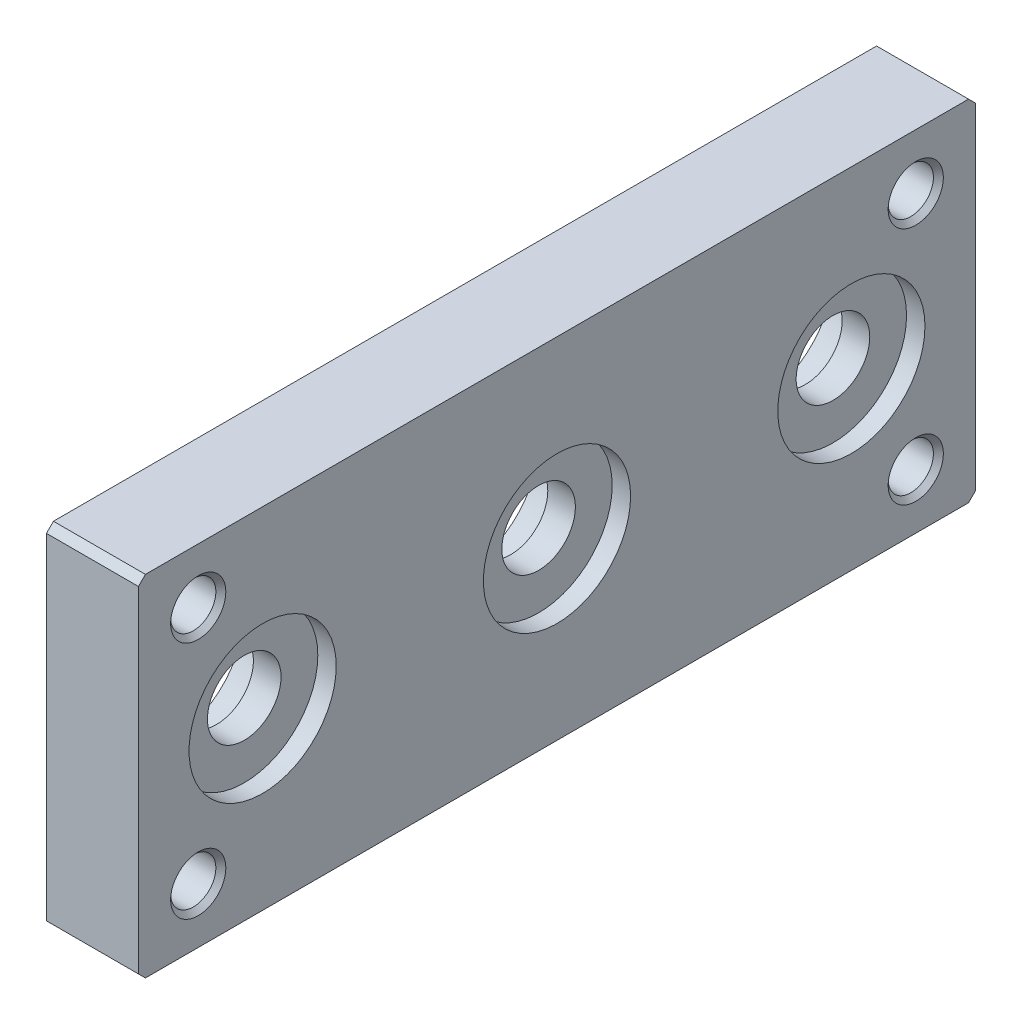
ISO-10303-21;
HEADER;
FILE_DESCRIPTION(('STEP AP214'),'2;1');
FILE_NAME('part.step','',(''),(''),'','','');
FILE_SCHEMA(('AUTOMOTIVE_DESIGN { 1 0 10303 214 1 1 1 1 }'));
ENDSEC;
DATA;
#1=APPLICATION_CONTEXT('core data for automotive mechanical design processes');
#2=APPLICATION_PROTOCOL_DEFINITION('international standard','automotive_design',2000,#1);
#3=PRODUCT_CONTEXT('',#1,'mechanical');
#4=PRODUCT('Part','Part','',(#3));
#5=PRODUCT_RELATED_PRODUCT_CATEGORY('part','',(#4));
#6=PRODUCT_DEFINITION_FORMATION('','',#4);
#7=PRODUCT_DEFINITION_CONTEXT('part definition',#1,'design');
#8=PRODUCT_DEFINITION('design','',#6,#7);
#9=PRODUCT_DEFINITION_SHAPE('','',#8);
#10=(LENGTH_UNIT() NAMED_UNIT(*) SI_UNIT(.MILLI.,.METRE.));
#11=(NAMED_UNIT(*) PLANE_ANGLE_UNIT() SI_UNIT($,.RADIAN.));
#12=(NAMED_UNIT(*) SI_UNIT($,.STERADIAN.) SOLID_ANGLE_UNIT());
#13=UNCERTAINTY_MEASURE_WITH_UNIT(LENGTH_MEASURE(1.E-05),#10,'distance_accuracy_value','');
#14=(GEOMETRIC_REPRESENTATION_CONTEXT(3) GLOBAL_UNCERTAINTY_ASSIGNED_CONTEXT((#13)) GLOBAL_UNIT_ASSIGNED_CONTEXT((#10,
#11,#12)) REPRESENTATION_CONTEXT('',''));
#15=CARTESIAN_POINT('',(0.,0.,0.));
#16=DIRECTION('',(0.,0.,1.));
#17=DIRECTION('',(1.,0.,0.));
#18=AXIS2_PLACEMENT_3D('',#15,#16,#17);
#19=CARTESIAN_POINT('',(-2.84529946162075,0.,-17.));
#20=DIRECTION('',(1.,0.,0.));
#21=DIRECTION('',(0.,0.,-1.));
#22=AXIS2_PLACEMENT_3D('',#19,#20,#21);
#23=CYLINDRICAL_SURFACE('',#22,2.);
#24=CARTESIAN_POINT('',(-7.,0.,-17.));
#25=DIRECTION('',(1.,0.,0.));
#26=DIRECTION('',(0.,0.,-1.));
#27=AXIS2_PLACEMENT_3D('',#24,#25,#26);
#28=CIRCLE('',#27,2.);
#29=CARTESIAN_POINT('',(-7.,2.,-17.));
#30=VERTEX_POINT('',#29);
#31=CARTESIAN_POINT('',(-7.,-2.,-17.));
#32=VERTEX_POINT('',#31);
#33=EDGE_CURVE('E387',#30,#32,#28,.T.);
#34=ORIENTED_EDGE('',*,*,#33,.F.);
#35=CARTESIAN_POINT('',(-7.,0.,-17.));
#36=DIRECTION('',(1.,0.,0.));
#37=DIRECTION('',(0.,0.,-1.));
#38=AXIS2_PLACEMENT_3D('',#35,#36,#37);
#39=CIRCLE('',#38,2.);
#40=EDGE_CURVE('E27',#32,#30,#39,.T.);
#41=ORIENTED_EDGE('',*,*,#40,.F.);
#42=EDGE_LOOP('',(#34,#41));
#43=FACE_BOUND('',#42,.T.);
#44=CARTESIAN_POINT('',(-4.,0.,-17.));
#45=DIRECTION('',(1.,0.,0.));
#46=DIRECTION('',(0.,0.,-1.));
#47=AXIS2_PLACEMENT_3D('',#44,#45,#46);
#48=CIRCLE('',#47,2.);
#49=CARTESIAN_POINT('',(-4.,0.,-19.));
#50=VERTEX_POINT('',#49);
#51=EDGE_CURVE('E11',#50,#50,#48,.T.);
#52=ORIENTED_EDGE('',*,*,#51,.T.);
#53=EDGE_LOOP('',(#52));
#54=FACE_BOUND('',#53,.T.);
#55=ADVANCED_FACE('F16',(#43,#54),#23,.F.);
#56=CARTESIAN_POINT('',(-4.,0.,-17.));
#57=DIRECTION('',(-1.,0.,0.));
#58=DIRECTION('',(0.,0.,1.));
#59=AXIS2_PLACEMENT_3D('',#56,#57,#58);
#60=CONICAL_SURFACE('',#59,2.,1.0471975511966);
#61=ORIENTED_EDGE('',*,*,#51,.F.);
#62=EDGE_LOOP('',(#61));
#63=FACE_BOUND('',#62,.T.);
#64=CARTESIAN_POINT('',(-2.84529946162075,0.,-17.));
#65=VERTEX_POINT('',#64);
#66=VERTEX_LOOP('',#65);
#67=FACE_BOUND('',#66,.T.);
#68=ADVANCED_FACE('F480',(#63,#67),#60,.F.);
#69=CARTESIAN_POINT('',(-7.,0.,-16.75));
#70=DIRECTION('',(1.,0.,0.));
#71=DIRECTION('',(0.,1.,0.));
#72=AXIS2_PLACEMENT_3D('',#69,#70,#71);
#73=PLANE('',#72);
#74=DIRECTION('',(0.,0.,-1.));
#75=VECTOR('',#74,1.);
#76=CARTESIAN_POINT('',(-7.,-2.,-16.75));
#77=LINE('',#76,#75);
#78=CARTESIAN_POINT('',(-7.,-2.,-17.25));
#79=VERTEX_POINT('',#78);
#80=EDGE_CURVE('E617',#32,#79,#77,.T.);
#81=ORIENTED_EDGE('',*,*,#80,.F.);
#82=ORIENTED_EDGE('',*,*,#40,.T.);
#83=DIRECTION('',(0.,0.,1.));
#84=VECTOR('',#83,1.);
#85=CARTESIAN_POINT('',(-7.,2.,-17.25));
#86=LINE('',#85,#84);
#87=CARTESIAN_POINT('',(-7.,2.,-17.25));
#88=VERTEX_POINT('',#87);
#89=EDGE_CURVE('E251',#88,#30,#86,.T.);
#90=ORIENTED_EDGE('',*,*,#89,.F.);
#91=CARTESIAN_POINT('',(-7.,0.,-17.25));
#92=DIRECTION('',(1.,0.,0.));
#93=DIRECTION('',(0.,0.,-1.));
#94=AXIS2_PLACEMENT_3D('',#91,#92,#93);
#95=CIRCLE('',#94,2.);
#96=EDGE_CURVE('E246',#79,#88,#95,.T.);
#97=ORIENTED_EDGE('',*,*,#96,.F.);
#98=EDGE_LOOP('',(#81,#82,#90,#97));
#99=FACE_BOUND('',#98,.T.);
#100=ADVANCED_FACE('F485',(#99),#73,.F.);
#101=CARTESIAN_POINT('',(-7.,0.,-17.25));
#102=DIRECTION('',(-1.,0.,0.));
#103=DIRECTION('',(0.,0.,1.));
#104=AXIS2_PLACEMENT_3D('',#101,#102,#103);
#105=CYLINDRICAL_SURFACE('',#104,2.);
#106=CARTESIAN_POINT('',(-10.,0.,-17.25));
#107=DIRECTION('',(1.,0.,0.));
#108=DIRECTION('',(0.,0.,-1.));
#109=AXIS2_PLACEMENT_3D('',#106,#107,#108);
#110=CIRCLE('',#109,2.);
#111=CARTESIAN_POINT('',(-10.,-2.,-17.25));
#112=VERTEX_POINT('',#111);
#113=CARTESIAN_POINT('',(-10.,2.,-17.25));
#114=VERTEX_POINT('',#113);
#115=EDGE_CURVE('E244',#112,#114,#110,.T.);
#116=ORIENTED_EDGE('',*,*,#115,.F.);
#117=DIRECTION('',(-1.,0.,0.));
#118=VECTOR('',#117,1.);
#119=CARTESIAN_POINT('',(-7.,-2.,-17.25));
#120=LINE('',#119,#118);
#121=EDGE_CURVE('E392',#79,#112,#120,.T.);
#122=ORIENTED_EDGE('',*,*,#121,.F.);
#123=ORIENTED_EDGE('',*,*,#96,.T.);
#124=DIRECTION('',(-1.,0.,0.));
#125=VECTOR('',#124,1.);
#126=CARTESIAN_POINT('',(-7.,2.,-17.25));
#127=LINE('',#126,#125);
#128=EDGE_CURVE('E239',#88,#114,#127,.T.);
#129=ORIENTED_EDGE('',*,*,#128,.T.);
#130=EDGE_LOOP('',(#116,#122,#123,#129));
#131=FACE_BOUND('',#130,.T.);
#132=ADVANCED_FACE('F241',(#131),#105,.F.);
#133=CARTESIAN_POINT('',(-7.,0.,-16.75));
#134=DIRECTION('',(-1.,0.,0.));
#135=DIRECTION('',(0.,0.,1.));
#136=AXIS2_PLACEMENT_3D('',#133,#134,#135);
#137=CYLINDRICAL_SURFACE('',#136,2.);
#138=CARTESIAN_POINT('',(-10.,0.,-16.75));
#139=DIRECTION('',(1.,0.,0.));
#140=DIRECTION('',(0.,0.,-1.));
#141=AXIS2_PLACEMENT_3D('',#138,#139,#140);
#142=CIRCLE('',#141,2.);
#143=CARTESIAN_POINT('',(-10.,2.,-16.75));
#144=VERTEX_POINT('',#143);
#145=CARTESIAN_POINT('',(-10.,-2.,-16.75));
#146=VERTEX_POINT('',#145);
#147=EDGE_CURVE('E274',#144,#146,#142,.T.);
#148=ORIENTED_EDGE('',*,*,#147,.F.);
#149=DIRECTION('',(-1.,0.,0.));
#150=VECTOR('',#149,1.);
#151=CARTESIAN_POINT('',(-7.,2.,-16.75));
#152=LINE('',#151,#150);
#153=CARTESIAN_POINT('',(-7.,2.,-16.75));
#154=VERTEX_POINT('',#153);
#155=EDGE_CURVE('E259',#154,#144,#152,.T.);
#156=ORIENTED_EDGE('',*,*,#155,.F.);
#157=CARTESIAN_POINT('',(-7.,0.,-16.75));
#158=DIRECTION('',(1.,0.,0.));
#159=DIRECTION('',(0.,0.,-1.));
#160=AXIS2_PLACEMENT_3D('',#157,#158,#159);
#161=CIRCLE('',#160,2.);
#162=CARTESIAN_POINT('',(-7.,-2.,-16.75));
#163=VERTEX_POINT('',#162);
#164=EDGE_CURVE('E391',#154,#163,#161,.T.);
#165=ORIENTED_EDGE('',*,*,#164,.T.);
#166=DIRECTION('',(-1.,0.,0.));
#167=VECTOR('',#166,1.);
#168=CARTESIAN_POINT('',(-7.,-2.,-16.75));
#169=LINE('',#168,#167);
#170=EDGE_CURVE('E295',#163,#146,#169,.T.);
#171=ORIENTED_EDGE('',*,*,#170,.T.);
#172=EDGE_LOOP('',(#148,#156,#165,#171));
#173=FACE_BOUND('',#172,.T.);
#174=ADVANCED_FACE('F547',(#173),#137,.F.);
#175=CARTESIAN_POINT('',(-7.,0.,-16.75));
#176=DIRECTION('',(1.,0.,0.));
#177=DIRECTION('',(0.,1.,0.));
#178=AXIS2_PLACEMENT_3D('',#175,#176,#177);
#179=PLANE('',#178);
#180=ORIENTED_EDGE('',*,*,#33,.T.);
#181=DIRECTION('',(0.,0.,-1.));
#182=VECTOR('',#181,1.);
#183=CARTESIAN_POINT('',(-7.,-2.,-16.75));
#184=LINE('',#183,#182);
#185=EDGE_CURVE('E299',#163,#32,#184,.T.);
#186=ORIENTED_EDGE('',*,*,#185,.F.);
#187=ORIENTED_EDGE('',*,*,#164,.F.);
#188=DIRECTION('',(0.,0.,1.));
#189=VECTOR('',#188,1.);
#190=CARTESIAN_POINT('',(-7.,2.,-17.25));
#191=LINE('',#190,#189);
#192=EDGE_CURVE('E342',#30,#154,#191,.T.);
#193=ORIENTED_EDGE('',*,*,#192,.F.);
#194=EDGE_LOOP('',(#180,#186,#187,#193));
#195=FACE_BOUND('',#194,.T.);
#196=ADVANCED_FACE('F550',(#195),#179,.F.);
#197=CARTESIAN_POINT('',(-7.,-2.,-16.75));
#198=DIRECTION('',(0.,1.,0.));
#199=DIRECTION('',(1.,0.,0.));
#200=AXIS2_PLACEMENT_3D('',#197,#198,#199);
#201=PLANE('',#200);
#202=DIRECTION('',(0.,0.,-1.));
#203=VECTOR('',#202,1.);
#204=CARTESIAN_POINT('',(-10.,-2.,-16.75));
#205=LINE('',#204,#203);
#206=EDGE_CURVE('E267',#146,#112,#205,.T.);
#207=ORIENTED_EDGE('',*,*,#206,.F.);
#208=ORIENTED_EDGE('',*,*,#170,.F.);
#209=ORIENTED_EDGE('',*,*,#185,.T.);
#210=ORIENTED_EDGE('',*,*,#80,.T.);
#211=ORIENTED_EDGE('',*,*,#121,.T.);
#212=EDGE_LOOP('',(#207,#208,#209,#210,#211));
#213=FACE_BOUND('',#212,.T.);
#214=ADVANCED_FACE('F530',(#213),#201,.T.);
#215=CARTESIAN_POINT('',(-7.,2.,-17.25));
#216=DIRECTION('',(0.,-1.,0.));
#217=DIRECTION('',(0.,0.,-1.));
#218=AXIS2_PLACEMENT_3D('',#215,#216,#217);
#219=PLANE('',#218);
#220=DIRECTION('',(0.,0.,1.));
#221=VECTOR('',#220,1.);
#222=CARTESIAN_POINT('',(-10.,2.,-17.25));
#223=LINE('',#222,#221);
#224=EDGE_CURVE('E255',#114,#144,#223,.T.);
#225=ORIENTED_EDGE('',*,*,#224,.F.);
#226=ORIENTED_EDGE('',*,*,#128,.F.);
#227=ORIENTED_EDGE('',*,*,#89,.T.);
#228=ORIENTED_EDGE('',*,*,#192,.T.);
#229=ORIENTED_EDGE('',*,*,#155,.T.);
#230=EDGE_LOOP('',(#225,#226,#227,#228,#229));
#231=FACE_BOUND('',#230,.T.);
#232=ADVANCED_FACE('F256',(#231),#219,.T.);
#233=CARTESIAN_POINT('',(-4.,0.,17.));
#234=DIRECTION('',(-1.,0.,0.));
#235=DIRECTION('',(0.,0.,1.));
#236=AXIS2_PLACEMENT_3D('',#233,#234,#235);
#237=CONICAL_SURFACE('',#236,2.,1.0471975511966);
#238=CARTESIAN_POINT('',(-4.,0.,17.));
#239=DIRECTION('',(1.,0.,0.));
#240=DIRECTION('',(0.,0.,-1.));
#241=AXIS2_PLACEMENT_3D('',#238,#239,#240);
#242=CIRCLE('',#241,2.);
#243=CARTESIAN_POINT('',(-4.,0.,15.));
#244=VERTEX_POINT('',#243);
#245=EDGE_CURVE('E252',#244,#244,#242,.T.);
#246=ORIENTED_EDGE('',*,*,#245,.F.);
#247=EDGE_LOOP('',(#246));
#248=FACE_BOUND('',#247,.T.);
#249=CARTESIAN_POINT('',(-2.84529946162075,0.,17.));
#250=VERTEX_POINT('',#249);
#251=VERTEX_LOOP('',#250);
#252=FACE_BOUND('',#251,.T.);
#253=ADVANCED_FACE('F473',(#248,#252),#237,.F.);
#254=CARTESIAN_POINT('',(-2.84529946162075,0.,17.));
#255=DIRECTION('',(1.,0.,0.));
#256=DIRECTION('',(0.,0.,-1.));
#257=AXIS2_PLACEMENT_3D('',#254,#255,#256);
#258=CYLINDRICAL_SURFACE('',#257,2.);
#259=CARTESIAN_POINT('',(-10.,0.,17.));
#260=DIRECTION('',(1.,0.,0.));
#261=DIRECTION('',(0.,0.,-1.));
#262=AXIS2_PLACEMENT_3D('',#259,#260,#261);
#263=CIRCLE('',#262,2.);
#264=CARTESIAN_POINT('',(-10.,0.,15.));
#265=VERTEX_POINT('',#264);
#266=EDGE_CURVE('E232',#265,#265,#263,.T.);
#267=ORIENTED_EDGE('',*,*,#266,.F.);
#268=EDGE_LOOP('',(#267));
#269=FACE_BOUND('',#268,.T.);
#270=ORIENTED_EDGE('',*,*,#245,.T.);
#271=EDGE_LOOP('',(#270));
#272=FACE_BOUND('',#271,.T.);
#273=ADVANCED_FACE('F462',(#269,#272),#258,.F.);
#274=CARTESIAN_POINT('',(0.,0.,0.));
#275=DIRECTION('',(1.,0.,0.));
#276=DIRECTION('',(0.,0.,-1.));
#277=AXIS2_PLACEMENT_3D('',#274,#275,#276);
#278=CYLINDRICAL_SURFACE('',#277,8.);
#279=CARTESIAN_POINT('',(-2.,0.,0.));
#280=DIRECTION('',(1.,0.,0.));
#281=DIRECTION('',(0.,0.,-1.));
#282=AXIS2_PLACEMENT_3D('',#279,#280,#281);
#283=CIRCLE('',#282,8.);
#284=CARTESIAN_POINT('',(-2.,0.,-8.));
#285=VERTEX_POINT('',#284);
#286=EDGE_CURVE('E284',#285,#285,#283,.T.);
#287=ORIENTED_EDGE('',*,*,#286,.F.);
#288=EDGE_LOOP('',(#287));
#289=FACE_BOUND('',#288,.T.);
#290=CARTESIAN_POINT('',(0.,0.,0.));
#291=DIRECTION('',(1.,0.,0.));
#292=DIRECTION('',(0.,0.,-1.));
#293=AXIS2_PLACEMENT_3D('',#290,#291,#292);
#294=CIRCLE('',#293,8.);
#295=CARTESIAN_POINT('',(0.,0.,-8.));
#296=VERTEX_POINT('',#295);
#297=EDGE_CURVE('E351',#296,#296,#294,.T.);
#298=ORIENTED_EDGE('',*,*,#297,.T.);
#299=EDGE_LOOP('',(#298));
#300=FACE_BOUND('',#299,.T.);
#301=ADVANCED_FACE('F459',(#289,#300),#278,.F.);
#302=CARTESIAN_POINT('',(-2.,0.,-4.));
#303=DIRECTION('',(1.,0.,0.));
#304=DIRECTION('',(0.,1.,0.));
#305=AXIS2_PLACEMENT_3D('',#302,#303,#304);
#306=PLANE('',#305);
#307=CARTESIAN_POINT('',(-2.,0.,0.));
#308=DIRECTION('',(1.,0.,0.));
#309=DIRECTION('',(0.,0.,-1.));
#310=AXIS2_PLACEMENT_3D('',#307,#308,#309);
#311=CIRCLE('',#310,4.);
#312=CARTESIAN_POINT('',(-2.,0.,-4.));
#313=VERTEX_POINT('',#312);
#314=EDGE_CURVE('E288',#313,#313,#311,.T.);
#315=ORIENTED_EDGE('',*,*,#314,.F.);
#316=EDGE_LOOP('',(#315));
#317=FACE_BOUND('',#316,.T.);
#318=ORIENTED_EDGE('',*,*,#286,.T.);
#319=EDGE_LOOP('',(#318));
#320=FACE_BOUND('',#319,.T.);
#321=ADVANCED_FACE('F461',(#317,#320),#306,.T.);
#322=CARTESIAN_POINT('',(0.,0.,0.));
#323=DIRECTION('',(1.,0.,0.));
#324=DIRECTION('',(0.,0.,-1.));
#325=AXIS2_PLACEMENT_3D('',#322,#323,#324);
#326=CYLINDRICAL_SURFACE('',#325,4.);
#327=CARTESIAN_POINT('',(-5.,0.,0.));
#328=DIRECTION('',(1.,0.,0.));
#329=DIRECTION('',(0.,0.,-1.));
#330=AXIS2_PLACEMENT_3D('',#327,#328,#329);
#331=CIRCLE('',#330,4.);
#332=CARTESIAN_POINT('',(-5.,0.,-4.));
#333=VERTEX_POINT('',#332);
#334=EDGE_CURVE('E306',#333,#333,#331,.T.);
#335=ORIENTED_EDGE('',*,*,#334,.F.);
#336=EDGE_LOOP('',(#335));
#337=FACE_BOUND('',#336,.T.);
#338=ORIENTED_EDGE('',*,*,#314,.T.);
#339=EDGE_LOOP('',(#338));
#340=FACE_BOUND('',#339,.T.);
#341=ADVANCED_FACE('F470',(#337,#340),#326,.F.);
#342=CARTESIAN_POINT('',(-5.,0.,-8.));
#343=DIRECTION('',(-1.,0.,0.));
#344=DIRECTION('',(0.,0.,1.));
#345=AXIS2_PLACEMENT_3D('',#342,#343,#344);
#346=PLANE('',#345);
#347=CARTESIAN_POINT('',(-5.,0.,0.));
#348=DIRECTION('',(1.,0.,0.));
#349=DIRECTION('',(0.,0.,-1.));
#350=AXIS2_PLACEMENT_3D('',#347,#348,#349);
#351=CIRCLE('',#350,8.);
#352=CARTESIAN_POINT('',(-5.,0.,-8.));
#353=VERTEX_POINT('',#352);
#354=EDGE_CURVE('E358',#353,#353,#351,.T.);
#355=ORIENTED_EDGE('',*,*,#354,.F.);
#356=EDGE_LOOP('',(#355));
#357=FACE_BOUND('',#356,.T.);
#358=ORIENTED_EDGE('',*,*,#334,.T.);
#359=EDGE_LOOP('',(#358));
#360=FACE_BOUND('',#359,.T.);
#361=ADVANCED_FACE('F522',(#357,#360),#346,.T.);
#362=CARTESIAN_POINT('',(0.,0.,0.));
#363=DIRECTION('',(1.,0.,0.));
#364=DIRECTION('',(0.,0.,-1.));
#365=AXIS2_PLACEMENT_3D('',#362,#363,#364);
#366=CYLINDRICAL_SURFACE('',#365,8.);
#367=CARTESIAN_POINT('',(-10.,0.,0.));
#368=DIRECTION('',(1.,0.,0.));
#369=DIRECTION('',(0.,0.,-1.));
#370=AXIS2_PLACEMENT_3D('',#367,#368,#369);
#371=CIRCLE('',#370,8.);
#372=CARTESIAN_POINT('',(-10.,0.,-8.));
#373=VERTEX_POINT('',#372);
#374=EDGE_CURVE('E314',#373,#373,#371,.T.);
#375=ORIENTED_EDGE('',*,*,#374,.F.);
#376=EDGE_LOOP('',(#375));
#377=FACE_BOUND('',#376,.T.);
#378=ORIENTED_EDGE('',*,*,#354,.T.);
#379=EDGE_LOOP('',(#378));
#380=FACE_BOUND('',#379,.T.);
#381=ADVANCED_FACE('F519',(#377,#380),#366,.F.);
#382=CARTESIAN_POINT('',(0.,0.,32.));
#383=DIRECTION('',(1.,0.,0.));
#384=DIRECTION('',(0.,0.,-1.));
#385=AXIS2_PLACEMENT_3D('',#382,#383,#384);
#386=CYLINDRICAL_SURFACE('',#385,8.);
#387=CARTESIAN_POINT('',(-2.,0.,32.));
#388=DIRECTION('',(1.,0.,0.));
#389=DIRECTION('',(0.,0.,-1.));
#390=AXIS2_PLACEMENT_3D('',#387,#388,#389);
#391=CIRCLE('',#390,8.);
#392=CARTESIAN_POINT('',(-2.,0.,24.));
#393=VERTEX_POINT('',#392);
#394=EDGE_CURVE('E374',#393,#393,#391,.T.);
#395=ORIENTED_EDGE('',*,*,#394,.F.);
#396=EDGE_LOOP('',(#395));
#397=FACE_BOUND('',#396,.T.);
#398=CARTESIAN_POINT('',(0.,0.,32.));
#399=DIRECTION('',(1.,0.,0.));
#400=DIRECTION('',(0.,0.,-1.));
#401=AXIS2_PLACEMENT_3D('',#398,#399,#400);
#402=CIRCLE('',#401,8.);
#403=CARTESIAN_POINT('',(0.,0.,24.));
#404=VERTEX_POINT('',#403);
#405=EDGE_CURVE('E347',#404,#404,#402,.T.);
#406=ORIENTED_EDGE('',*,*,#405,.T.);
#407=EDGE_LOOP('',(#406));
#408=FACE_BOUND('',#407,.T.);
#409=ADVANCED_FACE('F515',(#397,#408),#386,.F.);
#410=CARTESIAN_POINT('',(-2.,0.,28.));
#411=DIRECTION('',(1.,0.,0.));
#412=DIRECTION('',(0.,1.,0.));
#413=AXIS2_PLACEMENT_3D('',#410,#411,#412);
#414=PLANE('',#413);
#415=CARTESIAN_POINT('',(-2.,0.,32.));
#416=DIRECTION('',(1.,0.,0.));
#417=DIRECTION('',(0.,0.,-1.));
#418=AXIS2_PLACEMENT_3D('',#415,#416,#417);
#419=CIRCLE('',#418,4.);
#420=CARTESIAN_POINT('',(-2.,0.,28.));
#421=VERTEX_POINT('',#420);
#422=EDGE_CURVE('E378',#421,#421,#419,.T.);
#423=ORIENTED_EDGE('',*,*,#422,.F.);
#424=EDGE_LOOP('',(#423));
#425=FACE_BOUND('',#424,.T.);
#426=ORIENTED_EDGE('',*,*,#394,.T.);
#427=EDGE_LOOP('',(#426));
#428=FACE_BOUND('',#427,.T.);
#429=ADVANCED_FACE('F518',(#425,#428),#414,.T.);
#430=CARTESIAN_POINT('',(0.,0.,32.));
#431=DIRECTION('',(1.,0.,0.));
#432=DIRECTION('',(0.,0.,-1.));
#433=AXIS2_PLACEMENT_3D('',#430,#431,#432);
#434=CYLINDRICAL_SURFACE('',#433,4.);
#435=CARTESIAN_POINT('',(-5.,0.,32.));
#436=DIRECTION('',(1.,0.,0.));
#437=DIRECTION('',(0.,0.,-1.));
#438=AXIS2_PLACEMENT_3D('',#435,#436,#437);
#439=CIRCLE('',#438,4.);
#440=CARTESIAN_POINT('',(-5.,0.,28.));
#441=VERTEX_POINT('',#440);
#442=EDGE_CURVE('E409',#441,#441,#439,.T.);
#443=ORIENTED_EDGE('',*,*,#442,.F.);
#444=EDGE_LOOP('',(#443));
#445=FACE_BOUND('',#444,.T.);
#446=ORIENTED_EDGE('',*,*,#422,.T.);
#447=EDGE_LOOP('',(#446));
#448=FACE_BOUND('',#447,.T.);
#449=ADVANCED_FACE('F508',(#445,#448),#434,.F.);
#450=CARTESIAN_POINT('',(-5.,0.,24.));
#451=DIRECTION('',(-1.,0.,0.));
#452=DIRECTION('',(0.,0.,1.));
#453=AXIS2_PLACEMENT_3D('',#450,#451,#452);
#454=PLANE('',#453);
#455=CARTESIAN_POINT('',(-5.,0.,32.));
#456=DIRECTION('',(1.,0.,0.));
#457=DIRECTION('',(0.,0.,-1.));
#458=AXIS2_PLACEMENT_3D('',#455,#456,#457);
#459=CIRCLE('',#458,8.);
#460=CARTESIAN_POINT('',(-5.,0.,24.));
#461=VERTEX_POINT('',#460);
#462=EDGE_CURVE('E283',#461,#461,#459,.T.);
#463=ORIENTED_EDGE('',*,*,#462,.F.);
#464=EDGE_LOOP('',(#463));
#465=FACE_BOUND('',#464,.T.);
#466=ORIENTED_EDGE('',*,*,#442,.T.);
#467=EDGE_LOOP('',(#466));
#468=FACE_BOUND('',#467,.T.);
#469=ADVANCED_FACE('F504',(#465,#468),#454,.T.);
#470=CARTESIAN_POINT('',(0.,0.,32.));
#471=DIRECTION('',(1.,0.,0.));
#472=DIRECTION('',(0.,0.,-1.));
#473=AXIS2_PLACEMENT_3D('',#470,#471,#472);
#474=CYLINDRICAL_SURFACE('',#473,8.);
#475=CARTESIAN_POINT('',(-10.,0.,32.));
#476=DIRECTION('',(1.,0.,0.));
#477=DIRECTION('',(0.,0.,-1.));
#478=AXIS2_PLACEMENT_3D('',#475,#476,#477);
#479=CIRCLE('',#478,8.);
#480=CARTESIAN_POINT('',(-10.,0.,24.));
#481=VERTEX_POINT('',#480);
#482=EDGE_CURVE('E317',#481,#481,#479,.T.);
#483=ORIENTED_EDGE('',*,*,#482,.F.);
#484=EDGE_LOOP('',(#483));
#485=FACE_BOUND('',#484,.T.);
#486=ORIENTED_EDGE('',*,*,#462,.T.);
#487=EDGE_LOOP('',(#486));
#488=FACE_BOUND('',#487,.T.);
#489=ADVANCED_FACE('F500',(#485,#488),#474,.F.);
#490=CARTESIAN_POINT('',(0.,0.,-32.));
#491=DIRECTION('',(1.,0.,0.));
#492=DIRECTION('',(0.,0.,-1.));
#493=AXIS2_PLACEMENT_3D('',#490,#491,#492);
#494=CYLINDRICAL_SURFACE('',#493,8.);
#495=CARTESIAN_POINT('',(-2.,0.,-32.));
#496=DIRECTION('',(1.,0.,0.));
#497=DIRECTION('',(0.,0.,-1.));
#498=AXIS2_PLACEMENT_3D('',#495,#496,#497);
#499=CIRCLE('',#498,8.);
#500=CARTESIAN_POINT('',(-2.,0.,-40.));
#501=VERTEX_POINT('',#500);
#502=EDGE_CURVE('E280',#501,#501,#499,.T.);
#503=ORIENTED_EDGE('',*,*,#502,.F.);
#504=EDGE_LOOP('',(#503));
#505=FACE_BOUND('',#504,.T.);
#506=CARTESIAN_POINT('',(0.,0.,-32.));
#507=DIRECTION('',(1.,0.,0.));
#508=DIRECTION('',(0.,0.,-1.));
#509=AXIS2_PLACEMENT_3D('',#506,#507,#508);
#510=CIRCLE('',#509,8.);
#511=CARTESIAN_POINT('',(0.,0.,-40.));
#512=VERTEX_POINT('',#511);
#513=EDGE_CURVE('E350',#512,#512,#510,.T.);
#514=ORIENTED_EDGE('',*,*,#513,.T.);
#515=EDGE_LOOP('',(#514));
#516=FACE_BOUND('',#515,.T.);
#517=ADVANCED_FACE('F503',(#505,#516),#494,.F.);
#518=CARTESIAN_POINT('',(-2.,0.,-36.));
#519=DIRECTION('',(1.,0.,0.));
#520=DIRECTION('',(0.,1.,0.));
#521=AXIS2_PLACEMENT_3D('',#518,#519,#520);
#522=PLANE('',#521);
#523=CARTESIAN_POINT('',(-2.,0.,-32.));
#524=DIRECTION('',(1.,0.,0.));
#525=DIRECTION('',(0.,0.,-1.));
#526=AXIS2_PLACEMENT_3D('',#523,#524,#525);
#527=CIRCLE('',#526,4.);
#528=CARTESIAN_POINT('',(-2.,0.,-36.));
#529=VERTEX_POINT('',#528);
#530=EDGE_CURVE('E52',#529,#529,#527,.T.);
#531=ORIENTED_EDGE('',*,*,#530,.F.);
#532=EDGE_LOOP('',(#531));
#533=FACE_BOUND('',#532,.T.);
#534=ORIENTED_EDGE('',*,*,#502,.T.);
#535=EDGE_LOOP('',(#534));
#536=FACE_BOUND('',#535,.T.);
#537=ADVANCED_FACE('F531',(#533,#536),#522,.T.);
#538=CARTESIAN_POINT('',(0.,0.,-32.));
#539=DIRECTION('',(1.,0.,0.));
#540=DIRECTION('',(0.,0.,-1.));
#541=AXIS2_PLACEMENT_3D('',#538,#539,#540);
#542=CYLINDRICAL_SURFACE('',#541,4.);
#543=CARTESIAN_POINT('',(-5.,0.,-32.));
#544=DIRECTION('',(1.,0.,0.));
#545=DIRECTION('',(0.,0.,-1.));
#546=AXIS2_PLACEMENT_3D('',#543,#544,#545);
#547=CIRCLE('',#546,4.);
#548=CARTESIAN_POINT('',(-5.,0.,-36.));
#549=VERTEX_POINT('',#548);
#550=EDGE_CURVE('E64',#549,#549,#547,.T.);
#551=ORIENTED_EDGE('',*,*,#550,.F.);
#552=EDGE_LOOP('',(#551));
#553=FACE_BOUND('',#552,.T.);
#554=ORIENTED_EDGE('',*,*,#530,.T.);
#555=EDGE_LOOP('',(#554));
#556=FACE_BOUND('',#555,.T.);
#557=ADVANCED_FACE('F534',(#553,#556),#542,.F.);
#558=CARTESIAN_POINT('',(-5.,0.,-40.));
#559=DIRECTION('',(-1.,0.,0.));
#560=DIRECTION('',(0.,0.,1.));
#561=AXIS2_PLACEMENT_3D('',#558,#559,#560);
#562=PLANE('',#561);
#563=CARTESIAN_POINT('',(-5.,0.,-32.));
#564=DIRECTION('',(1.,0.,0.));
#565=DIRECTION('',(0.,0.,-1.));
#566=AXIS2_PLACEMENT_3D('',#563,#564,#565);
#567=CIRCLE('',#566,8.);
#568=CARTESIAN_POINT('',(-5.,0.,-40.));
#569=VERTEX_POINT('',#568);
#570=EDGE_CURVE('E333',#569,#569,#567,.T.);
#571=ORIENTED_EDGE('',*,*,#570,.F.);
#572=EDGE_LOOP('',(#571));
#573=FACE_BOUND('',#572,.T.);
#574=ORIENTED_EDGE('',*,*,#550,.T.);
#575=EDGE_LOOP('',(#574));
#576=FACE_BOUND('',#575,.T.);
#577=ADVANCED_FACE('F498',(#573,#576),#562,.T.);
#578=CARTESIAN_POINT('',(0.,0.,-32.));
#579=DIRECTION('',(1.,0.,0.));
#580=DIRECTION('',(0.,0.,-1.));
#581=AXIS2_PLACEMENT_3D('',#578,#579,#580);
#582=CYLINDRICAL_SURFACE('',#581,8.);
#583=CARTESIAN_POINT('',(-10.,0.,-32.));
#584=DIRECTION('',(1.,0.,0.));
#585=DIRECTION('',(0.,0.,-1.));
#586=AXIS2_PLACEMENT_3D('',#583,#584,#585);
#587=CIRCLE('',#586,8.);
#588=CARTESIAN_POINT('',(-10.,0.,-40.));
#589=VERTEX_POINT('',#588);
#590=EDGE_CURVE('E403',#589,#589,#587,.T.);
#591=ORIENTED_EDGE('',*,*,#590,.F.);
#592=EDGE_LOOP('',(#591));
#593=FACE_BOUND('',#592,.T.);
#594=ORIENTED_EDGE('',*,*,#570,.T.);
#595=EDGE_LOOP('',(#594));
#596=FACE_BOUND('',#595,.T.);
#597=ADVANCED_FACE('F441',(#593,#596),#582,.F.);
#598=CARTESIAN_POINT('',(-0.5415,13.,-39.));
#599=DIRECTION('',(1.,0.,0.));
#600=DIRECTION('',(0.,0.,-1.));
#601=AXIS2_PLACEMENT_3D('',#598,#599,#600);
#602=CONICAL_SURFACE('',#601,2.4585,0.785398163397448);
#603=CARTESIAN_POINT('',(-0.5415,13.,-39.));
#604=DIRECTION('',(1.,0.,0.));
#605=DIRECTION('',(0.,0.,-1.));
#606=AXIS2_PLACEMENT_3D('',#603,#604,#605);
#607=CIRCLE('',#606,2.4585);
#608=CARTESIAN_POINT('',(-0.5415,13.,-41.4585));
#609=VERTEX_POINT('',#608);
#610=EDGE_CURVE('E329',#609,#609,#607,.T.);
#611=ORIENTED_EDGE('',*,*,#610,.F.);
#612=EDGE_LOOP('',(#611));
#613=FACE_BOUND('',#612,.T.);
#614=CARTESIAN_POINT('',(0.,13.,-39.));
#615=DIRECTION('',(1.,0.,0.));
#616=DIRECTION('',(0.,0.,-1.));
#617=AXIS2_PLACEMENT_3D('',#614,#615,#616);
#618=CIRCLE('',#617,3.);
#619=CARTESIAN_POINT('',(0.,13.,-42.));
#620=VERTEX_POINT('',#619);
#621=EDGE_CURVE('E354',#620,#620,#618,.T.);
#622=ORIENTED_EDGE('',*,*,#621,.T.);
#623=EDGE_LOOP('',(#622));
#624=FACE_BOUND('',#623,.T.);
#625=ADVANCED_FACE('F433',(#613,#624),#602,.F.);
#626=CARTESIAN_POINT('',(0.,13.,-39.));
#627=DIRECTION('',(1.,0.,0.));
#628=DIRECTION('',(0.,0.,-1.));
#629=AXIS2_PLACEMENT_3D('',#626,#627,#628);
#630=CYLINDRICAL_SURFACE('',#629,2.4585);
#631=CARTESIAN_POINT('',(-9.4585,13.,-39.));
#632=DIRECTION('',(1.,0.,0.));
#633=DIRECTION('',(0.,0.,-1.));
#634=AXIS2_PLACEMENT_3D('',#631,#632,#633);
#635=CIRCLE('',#634,2.4585);
#636=CARTESIAN_POINT('',(-9.4585,13.,-41.4585));
#637=VERTEX_POINT('',#636);
#638=EDGE_CURVE('E334',#637,#637,#635,.T.);
#639=ORIENTED_EDGE('',*,*,#638,.F.);
#640=EDGE_LOOP('',(#639));
#641=FACE_BOUND('',#640,.T.);
#642=ORIENTED_EDGE('',*,*,#610,.T.);
#643=EDGE_LOOP('',(#642));
#644=FACE_BOUND('',#643,.T.);
#645=ADVANCED_FACE('F430',(#641,#644),#630,.F.);
#646=CARTESIAN_POINT('',(-10.,13.,-39.));
#647=DIRECTION('',(-1.,0.,0.));
#648=DIRECTION('',(0.,0.,1.));
#649=AXIS2_PLACEMENT_3D('',#646,#647,#648);
#650=CONICAL_SURFACE('',#649,3.,0.785398163397448);
#651=CARTESIAN_POINT('',(-10.,13.,-39.));
#652=DIRECTION('',(1.,0.,0.));
#653=DIRECTION('',(0.,0.,-1.));
#654=AXIS2_PLACEMENT_3D('',#651,#652,#653);
#655=CIRCLE('',#654,3.);
#656=CARTESIAN_POINT('',(-10.,13.,-42.));
#657=VERTEX_POINT('',#656);
#658=EDGE_CURVE('E373',#657,#657,#655,.T.);
#659=ORIENTED_EDGE('',*,*,#658,.F.);
#660=EDGE_LOOP('',(#659));
#661=FACE_BOUND('',#660,.T.);
#662=ORIENTED_EDGE('',*,*,#638,.T.);
#663=EDGE_LOOP('',(#662));
#664=FACE_BOUND('',#663,.T.);
#665=ADVANCED_FACE('F428',(#661,#664),#650,.F.);
#666=CARTESIAN_POINT('',(-0.5415,-13.,39.));
#667=DIRECTION('',(1.,0.,0.));
#668=DIRECTION('',(0.,0.,-1.));
#669=AXIS2_PLACEMENT_3D('',#666,#667,#668);
#670=CONICAL_SURFACE('',#669,2.4585,0.785398163397448);
#671=CARTESIAN_POINT('',(-0.5415,-13.,39.));
#672=DIRECTION('',(1.,0.,0.));
#673=DIRECTION('',(0.,0.,-1.));
#674=AXIS2_PLACEMENT_3D('',#671,#672,#673);
#675=CIRCLE('',#674,2.4585);
#676=CARTESIAN_POINT('',(-0.5415,-13.,36.5415));
#677=VERTEX_POINT('',#676);
#678=EDGE_CURVE('E420',#677,#677,#675,.T.);
#679=ORIENTED_EDGE('',*,*,#678,.F.);
#680=EDGE_LOOP('',(#679));
#681=FACE_BOUND('',#680,.T.);
#682=CARTESIAN_POINT('',(0.,-13.,39.));
#683=DIRECTION('',(1.,0.,0.));
#684=DIRECTION('',(0.,0.,-1.));
#685=AXIS2_PLACEMENT_3D('',#682,#683,#684);
#686=CIRCLE('',#685,3.);
#687=CARTESIAN_POINT('',(0.,-13.,36.));
#688=VERTEX_POINT('',#687);
#689=EDGE_CURVE('E302',#688,#688,#686,.T.);
#690=ORIENTED_EDGE('',*,*,#689,.T.);
#691=EDGE_LOOP('',(#690));
#692=FACE_BOUND('',#691,.T.);
#693=ADVANCED_FACE('F542',(#681,#692),#670,.F.);
#694=CARTESIAN_POINT('',(0.,-13.,39.));
#695=DIRECTION('',(1.,0.,0.));
#696=DIRECTION('',(0.,0.,-1.));
#697=AXIS2_PLACEMENT_3D('',#694,#695,#696);
#698=CYLINDRICAL_SURFACE('',#697,2.4585);
#699=CARTESIAN_POINT('',(-9.4585,-13.,39.));
#700=DIRECTION('',(1.,0.,0.));
#701=DIRECTION('',(0.,0.,-1.));
#702=AXIS2_PLACEMENT_3D('',#699,#700,#701);
#703=CIRCLE('',#702,2.4585);
#704=CARTESIAN_POINT('',(-9.4585,-13.,36.5415));
#705=VERTEX_POINT('',#704);
#706=EDGE_CURVE('E422',#705,#705,#703,.T.);
#707=ORIENTED_EDGE('',*,*,#706,.F.);
#708=EDGE_LOOP('',(#707));
#709=FACE_BOUND('',#708,.T.);
#710=ORIENTED_EDGE('',*,*,#678,.T.);
#711=EDGE_LOOP('',(#710));
#712=FACE_BOUND('',#711,.T.);
#713=ADVANCED_FACE('F545',(#709,#712),#698,.F.);
#714=CARTESIAN_POINT('',(-10.,-13.,39.));
#715=DIRECTION('',(-1.,0.,0.));
#716=DIRECTION('',(0.,0.,1.));
#717=AXIS2_PLACEMENT_3D('',#714,#715,#716);
#718=CONICAL_SURFACE('',#717,3.,0.785398163397448);
#719=CARTESIAN_POINT('',(-10.,-13.,39.));
#720=DIRECTION('',(1.,0.,0.));
#721=DIRECTION('',(0.,0.,-1.));
#722=AXIS2_PLACEMENT_3D('',#719,#720,#721);
#723=CIRCLE('',#722,3.);
#724=CARTESIAN_POINT('',(-10.,-13.,36.));
#725=VERTEX_POINT('',#724);
#726=EDGE_CURVE('E339',#725,#725,#723,.T.);
#727=ORIENTED_EDGE('',*,*,#726,.F.);
#728=EDGE_LOOP('',(#727));
#729=FACE_BOUND('',#728,.T.);
#730=ORIENTED_EDGE('',*,*,#706,.T.);
#731=EDGE_LOOP('',(#730));
#732=FACE_BOUND('',#731,.T.);
#733=ADVANCED_FACE('F949',(#729,#732),#718,.F.);
#734=CARTESIAN_POINT('',(-0.5415,-13.,-39.));
#735=DIRECTION('',(1.,0.,0.));
#736=DIRECTION('',(0.,0.,-1.));
#737=AXIS2_PLACEMENT_3D('',#734,#735,#736);
#738=CONICAL_SURFACE('',#737,2.4585,0.785398163397448);
#739=CARTESIAN_POINT('',(-0.5415,-13.,-39.));
#740=DIRECTION('',(1.,0.,0.));
#741=DIRECTION('',(0.,0.,-1.));
#742=AXIS2_PLACEMENT_3D('',#739,#740,#741);
#743=CIRCLE('',#742,2.4585);
#744=CARTESIAN_POINT('',(-0.5415,-13.,-41.4585));
#745=VERTEX_POINT('',#744);
#746=EDGE_CURVE('E610',#745,#745,#743,.T.);
#747=ORIENTED_EDGE('',*,*,#746,.F.);
#748=EDGE_LOOP('',(#747));
#749=FACE_BOUND('',#748,.T.);
#750=CARTESIAN_POINT('',(0.,-13.,-39.));
#751=DIRECTION('',(1.,0.,0.));
#752=DIRECTION('',(0.,0.,-1.));
#753=AXIS2_PLACEMENT_3D('',#750,#751,#752);
#754=CIRCLE('',#753,3.);
#755=CARTESIAN_POINT('',(0.,-13.,-42.));
#756=VERTEX_POINT('',#755);
#757=EDGE_CURVE('E172',#756,#756,#754,.T.);
#758=ORIENTED_EDGE('',*,*,#757,.T.);
#759=EDGE_LOOP('',(#758));
#760=FACE_BOUND('',#759,.T.);
#761=ADVANCED_FACE('F954',(#749,#760),#738,.F.);
#762=CARTESIAN_POINT('',(0.,-13.,-39.));
#763=DIRECTION('',(1.,0.,0.));
#764=DIRECTION('',(0.,0.,-1.));
#765=AXIS2_PLACEMENT_3D('',#762,#763,#764);
#766=CYLINDRICAL_SURFACE('',#765,2.4585);
#767=CARTESIAN_POINT('',(-9.4585,-13.,-39.));
#768=DIRECTION('',(1.,0.,0.));
#769=DIRECTION('',(0.,0.,-1.));
#770=AXIS2_PLACEMENT_3D('',#767,#768,#769);
#771=CIRCLE('',#770,2.4585);
#772=CARTESIAN_POINT('',(-9.4585,-13.,-41.4585));
#773=VERTEX_POINT('',#772);
#774=EDGE_CURVE('E623',#773,#773,#771,.T.);
#775=ORIENTED_EDGE('',*,*,#774,.F.);
#776=EDGE_LOOP('',(#775));
#777=FACE_BOUND('',#776,.T.);
#778=ORIENTED_EDGE('',*,*,#746,.T.);
#779=EDGE_LOOP('',(#778));
#780=FACE_BOUND('',#779,.T.);
#781=ADVANCED_FACE('F556',(#777,#780),#766,.F.);
#782=CARTESIAN_POINT('',(-10.,-13.,-39.));
#783=DIRECTION('',(-1.,0.,0.));
#784=DIRECTION('',(0.,0.,1.));
#785=AXIS2_PLACEMENT_3D('',#782,#783,#784);
#786=CONICAL_SURFACE('',#785,3.,0.785398163397448);
#787=CARTESIAN_POINT('',(-10.,-13.,-39.));
#788=DIRECTION('',(1.,0.,0.));
#789=DIRECTION('',(0.,0.,-1.));
#790=AXIS2_PLACEMENT_3D('',#787,#788,#789);
#791=CIRCLE('',#790,3.);
#792=CARTESIAN_POINT('',(-10.,-13.,-42.));
#793=VERTEX_POINT('',#792);
#794=EDGE_CURVE('E335',#793,#793,#791,.T.);
#795=ORIENTED_EDGE('',*,*,#794,.F.);
#796=EDGE_LOOP('',(#795));
#797=FACE_BOUND('',#796,.T.);
#798=ORIENTED_EDGE('',*,*,#774,.T.);
#799=EDGE_LOOP('',(#798));
#800=FACE_BOUND('',#799,.T.);
#801=ADVANCED_FACE('F552',(#797,#800),#786,.F.);
#802=CARTESIAN_POINT('',(-0.5415,13.,39.));
#803=DIRECTION('',(1.,0.,0.));
#804=DIRECTION('',(0.,0.,-1.));
#805=AXIS2_PLACEMENT_3D('',#802,#803,#804);
#806=CONICAL_SURFACE('',#805,2.4585,0.785398163397448);
#807=CARTESIAN_POINT('',(-0.5415,13.,39.));
#808=DIRECTION('',(1.,0.,0.));
#809=DIRECTION('',(0.,0.,-1.));
#810=AXIS2_PLACEMENT_3D('',#807,#808,#809);
#811=CIRCLE('',#810,2.4585);
#812=CARTESIAN_POINT('',(-0.5415,13.,36.5415));
#813=VERTEX_POINT('',#812);
#814=EDGE_CURVE('E627',#813,#813,#811,.T.);
#815=ORIENTED_EDGE('',*,*,#814,.F.);
#816=EDGE_LOOP('',(#815));
#817=FACE_BOUND('',#816,.T.);
#818=CARTESIAN_POINT('',(0.,13.,39.));
#819=DIRECTION('',(1.,0.,0.));
#820=DIRECTION('',(0.,0.,-1.));
#821=AXIS2_PLACEMENT_3D('',#818,#819,#820);
#822=CIRCLE('',#821,3.);
#823=CARTESIAN_POINT('',(0.,13.,36.));
#824=VERTEX_POINT('',#823);
#825=EDGE_CURVE('E159',#824,#824,#822,.T.);
#826=ORIENTED_EDGE('',*,*,#825,.T.);
#827=EDGE_LOOP('',(#826));
#828=FACE_BOUND('',#827,.T.);
#829=ADVANCED_FACE('F555',(#817,#828),#806,.F.);
#830=CARTESIAN_POINT('',(0.,13.,39.));
#831=DIRECTION('',(1.,0.,0.));
#832=DIRECTION('',(0.,0.,-1.));
#833=AXIS2_PLACEMENT_3D('',#830,#831,#832);
#834=CYLINDRICAL_SURFACE('',#833,2.4585);
#835=CARTESIAN_POINT('',(-9.4585,13.,39.));
#836=DIRECTION('',(1.,0.,0.));
#837=DIRECTION('',(0.,0.,-1.));
#838=AXIS2_PLACEMENT_3D('',#835,#836,#837);
#839=CIRCLE('',#838,2.4585);
#840=CARTESIAN_POINT('',(-9.4585,13.,36.5415));
#841=VERTEX_POINT('',#840);
#842=EDGE_CURVE('E686',#841,#841,#839,.T.);
#843=ORIENTED_EDGE('',*,*,#842,.F.);
#844=EDGE_LOOP('',(#843));
#845=FACE_BOUND('',#844,.T.);
#846=ORIENTED_EDGE('',*,*,#814,.T.);
#847=EDGE_LOOP('',(#846));
#848=FACE_BOUND('',#847,.T.);
#849=ADVANCED_FACE('F562',(#845,#848),#834,.F.);
#850=CARTESIAN_POINT('',(-10.,13.,39.));
#851=DIRECTION('',(-1.,0.,0.));
#852=DIRECTION('',(0.,0.,1.));
#853=AXIS2_PLACEMENT_3D('',#850,#851,#852);
#854=CONICAL_SURFACE('',#853,3.,0.785398163397448);
#855=CARTESIAN_POINT('',(-10.,13.,39.));
#856=DIRECTION('',(1.,0.,0.));
#857=DIRECTION('',(0.,0.,-1.));
#858=AXIS2_PLACEMENT_3D('',#855,#856,#857);
#859=CIRCLE('',#858,3.);
#860=CARTESIAN_POINT('',(-10.,13.,36.));
#861=VERTEX_POINT('',#860);
#862=EDGE_CURVE('E338',#861,#861,#859,.T.);
#863=ORIENTED_EDGE('',*,*,#862,.F.);
#864=EDGE_LOOP('',(#863));
#865=FACE_BOUND('',#864,.T.);
#866=ORIENTED_EDGE('',*,*,#842,.T.);
#867=EDGE_LOOP('',(#866));
#868=FACE_BOUND('',#867,.T.);
#869=ADVANCED_FACE('F449',(#865,#868),#854,.F.);
#870=CARTESIAN_POINT('',(0.,0.,0.));
#871=DIRECTION('',(1.,0.,0.));
#872=DIRECTION('',(0.,1.,0.));
#873=AXIS2_PLACEMENT_3D('',#870,#871,#872);
#874=PLANE('',#873);
#875=DIRECTION('',(0.,-0.707106781186552,0.707106781186543));
#876=VECTOR('',#875,1.);
#877=CARTESIAN_POINT('',(0.,19.,44.74));
#878=LINE('',#877,#876);
#879=CARTESIAN_POINT('',(0.,19.,44.74));
#880=VERTEX_POINT('',#879);
#881=CARTESIAN_POINT('',(0.,18.24,45.5));
#882=VERTEX_POINT('',#881);
#883=EDGE_CURVE('E307',#880,#882,#878,.T.);
#884=ORIENTED_EDGE('',*,*,#883,.T.);
#885=DIRECTION('',(0.,-1.,0.));
#886=VECTOR('',#885,1.);
#887=CARTESIAN_POINT('',(0.,18.24,45.5));
#888=LINE('',#887,#886);
#889=CARTESIAN_POINT('',(0.,-18.24,45.5));
#890=VERTEX_POINT('',#889);
#891=EDGE_CURVE('E415',#882,#890,#888,.T.);
#892=ORIENTED_EDGE('',*,*,#891,.T.);
#893=DIRECTION('',(0.,-0.707106781186549,-0.707106781186546));
#894=VECTOR('',#893,1.);
#895=CARTESIAN_POINT('',(0.,-18.24,45.5));
#896=LINE('',#895,#894);
#897=CARTESIAN_POINT('',(0.,-19.,44.74));
#898=VERTEX_POINT('',#897);
#899=EDGE_CURVE('E294',#890,#898,#896,.T.);
#900=ORIENTED_EDGE('',*,*,#899,.T.);
#901=DIRECTION('',(0.,0.,-1.));
#902=VECTOR('',#901,1.);
#903=CARTESIAN_POINT('',(0.,-19.,44.74));
#904=LINE('',#903,#902);
#905=CARTESIAN_POINT('',(0.,-19.,-44.74));
#906=VERTEX_POINT('',#905);
#907=EDGE_CURVE('E382',#898,#906,#904,.T.);
#908=ORIENTED_EDGE('',*,*,#907,.T.);
#909=DIRECTION('',(0.,0.707106781186549,-0.707106781186546));
#910=VECTOR('',#909,1.);
#911=CARTESIAN_POINT('',(0.,-19.,-44.74));
#912=LINE('',#911,#910);
#913=CARTESIAN_POINT('',(0.,-18.24,-45.5));
#914=VERTEX_POINT('',#913);
#915=EDGE_CURVE('E20',#906,#914,#912,.T.);
#916=ORIENTED_EDGE('',*,*,#915,.T.);
#917=DIRECTION('',(0.,1.,0.));
#918=VECTOR('',#917,1.);
#919=CARTESIAN_POINT('',(0.,-18.24,-45.5));
#920=LINE('',#919,#918);
#921=CARTESIAN_POINT('',(0.,18.24,-45.5));
#922=VERTEX_POINT('',#921);
#923=EDGE_CURVE('E634',#914,#922,#920,.T.);
#924=ORIENTED_EDGE('',*,*,#923,.T.);
#925=DIRECTION('',(0.,0.707106781186549,0.707106781186546));
#926=VECTOR('',#925,1.);
#927=CARTESIAN_POINT('',(0.,18.24,-45.5));
#928=LINE('',#927,#926);
#929=CARTESIAN_POINT('',(0.,19.,-44.74));
#930=VERTEX_POINT('',#929);
#931=EDGE_CURVE('E318',#922,#930,#928,.T.);
#932=ORIENTED_EDGE('',*,*,#931,.T.);
#933=DIRECTION('',(0.,0.,1.));
#934=VECTOR('',#933,1.);
#935=CARTESIAN_POINT('',(0.,19.,-44.74));
#936=LINE('',#935,#934);
#937=EDGE_CURVE('E327',#930,#880,#936,.T.);
#938=ORIENTED_EDGE('',*,*,#937,.T.);
#939=EDGE_LOOP('',(#884,#892,#900,#908,#916,#924,#932,#938));
#940=FACE_BOUND('',#939,.T.);
#941=ORIENTED_EDGE('',*,*,#825,.F.);
#942=EDGE_LOOP('',(#941));
#943=FACE_BOUND('',#942,.T.);
#944=ORIENTED_EDGE('',*,*,#757,.F.);
#945=EDGE_LOOP('',(#944));
#946=FACE_BOUND('',#945,.T.);
#947=ORIENTED_EDGE('',*,*,#689,.F.);
#948=EDGE_LOOP('',(#947));
#949=FACE_BOUND('',#948,.T.);
#950=ORIENTED_EDGE('',*,*,#621,.F.);
#951=EDGE_LOOP('',(#950));
#952=FACE_BOUND('',#951,.T.);
#953=ORIENTED_EDGE('',*,*,#513,.F.);
#954=EDGE_LOOP('',(#953));
#955=FACE_BOUND('',#954,.T.);
#956=ORIENTED_EDGE('',*,*,#405,.F.);
#957=EDGE_LOOP('',(#956));
#958=FACE_BOUND('',#957,.T.);
#959=ORIENTED_EDGE('',*,*,#297,.F.);
#960=EDGE_LOOP('',(#959));
#961=FACE_BOUND('',#960,.T.);
#962=ADVANCED_FACE('F18',(#940,#943,#946,#949,#952,#955,#958,#961),#874,.T.);
#963=CARTESIAN_POINT('',(-10.,0.,0.));
#964=DIRECTION('',(1.,0.,0.));
#965=DIRECTION('',(0.,1.,0.));
#966=AXIS2_PLACEMENT_3D('',#963,#964,#965);
#967=PLANE('',#966);
#968=DIRECTION('',(0.,-0.707106781186552,0.707106781186543));
#969=VECTOR('',#968,1.);
#970=CARTESIAN_POINT('',(-10.,19.,44.74));
#971=LINE('',#970,#969);
#972=CARTESIAN_POINT('',(-10.,19.,44.74));
#973=VERTEX_POINT('',#972);
#974=CARTESIAN_POINT('',(-10.,18.24,45.5));
#975=VERTEX_POINT('',#974);
#976=EDGE_CURVE('E346',#973,#975,#971,.T.);
#977=ORIENTED_EDGE('',*,*,#976,.F.);
#978=DIRECTION('',(0.,0.,1.));
#979=VECTOR('',#978,1.);
#980=CARTESIAN_POINT('',(-10.,19.,-44.74));
#981=LINE('',#980,#979);
#982=CARTESIAN_POINT('',(-10.,19.,-44.74));
#983=VERTEX_POINT('',#982);
#984=EDGE_CURVE('E397',#983,#973,#981,.T.);
#985=ORIENTED_EDGE('',*,*,#984,.F.);
#986=DIRECTION('',(0.,0.707106781186549,0.707106781186546));
#987=VECTOR('',#986,1.);
#988=CARTESIAN_POINT('',(-10.,18.24,-45.5));
#989=LINE('',#988,#987);
#990=CARTESIAN_POINT('',(-10.,18.24,-45.5));
#991=VERTEX_POINT('',#990);
#992=EDGE_CURVE('E322',#991,#983,#989,.T.);
#993=ORIENTED_EDGE('',*,*,#992,.F.);
#994=DIRECTION('',(0.,1.,0.));
#995=VECTOR('',#994,1.);
#996=CARTESIAN_POINT('',(-10.,-18.24,-45.5));
#997=LINE('',#996,#995);
#998=CARTESIAN_POINT('',(-10.,-18.24,-45.5));
#999=VERTEX_POINT('',#998);
#1000=EDGE_CURVE('E370',#999,#991,#997,.T.);
#1001=ORIENTED_EDGE('',*,*,#1000,.F.);
#1002=DIRECTION('',(0.,0.707106781186549,-0.707106781186546));
#1003=VECTOR('',#1002,1.);
#1004=CARTESIAN_POINT('',(-10.,-19.,-44.74));
#1005=LINE('',#1004,#1003);
#1006=CARTESIAN_POINT('',(-10.,-19.,-44.74));
#1007=VERTEX_POINT('',#1006);
#1008=EDGE_CURVE('E278',#1007,#999,#1005,.T.);
#1009=ORIENTED_EDGE('',*,*,#1008,.F.);
#1010=DIRECTION('',(0.,0.,-1.));
#1011=VECTOR('',#1010,1.);
#1012=CARTESIAN_POINT('',(-10.,-19.,44.74));
#1013=LINE('',#1012,#1011);
#1014=CARTESIAN_POINT('',(-10.,-19.,44.74));
#1015=VERTEX_POINT('',#1014);
#1016=EDGE_CURVE('E396',#1015,#1007,#1013,.T.);
#1017=ORIENTED_EDGE('',*,*,#1016,.F.);
#1018=DIRECTION('',(0.,-0.707106781186549,-0.707106781186546));
#1019=VECTOR('',#1018,1.);
#1020=CARTESIAN_POINT('',(-10.,-18.24,45.5));
#1021=LINE('',#1020,#1019);
#1022=CARTESIAN_POINT('',(-10.,-18.24,45.5));
#1023=VERTEX_POINT('',#1022);
#1024=EDGE_CURVE('E289',#1023,#1015,#1021,.T.);
#1025=ORIENTED_EDGE('',*,*,#1024,.F.);
#1026=DIRECTION('',(0.,-1.,0.));
#1027=VECTOR('',#1026,1.);
#1028=CARTESIAN_POINT('',(-10.,18.24,45.5));
#1029=LINE('',#1028,#1027);
#1030=EDGE_CURVE('E419',#975,#1023,#1029,.T.);
#1031=ORIENTED_EDGE('',*,*,#1030,.F.);
#1032=EDGE_LOOP('',(#977,#985,#993,#1001,#1009,#1017,#1025,#1031));
#1033=FACE_BOUND('',#1032,.T.);
#1034=ORIENTED_EDGE('',*,*,#862,.T.);
#1035=EDGE_LOOP('',(#1034));
#1036=FACE_BOUND('',#1035,.T.);
#1037=ORIENTED_EDGE('',*,*,#794,.T.);
#1038=EDGE_LOOP('',(#1037));
#1039=FACE_BOUND('',#1038,.T.);
#1040=ORIENTED_EDGE('',*,*,#726,.T.);
#1041=EDGE_LOOP('',(#1040));
#1042=FACE_BOUND('',#1041,.T.);
#1043=ORIENTED_EDGE('',*,*,#658,.T.);
#1044=EDGE_LOOP('',(#1043));
#1045=FACE_BOUND('',#1044,.T.);
#1046=ORIENTED_EDGE('',*,*,#590,.T.);
#1047=EDGE_LOOP('',(#1046));
#1048=FACE_BOUND('',#1047,.T.);
#1049=ORIENTED_EDGE('',*,*,#482,.T.);
#1050=EDGE_LOOP('',(#1049));
#1051=FACE_BOUND('',#1050,.T.);
#1052=ORIENTED_EDGE('',*,*,#374,.T.);
#1053=EDGE_LOOP('',(#1052));
#1054=FACE_BOUND('',#1053,.T.);
#1055=ORIENTED_EDGE('',*,*,#266,.T.);
#1056=EDGE_LOOP('',(#1055));
#1057=FACE_BOUND('',#1056,.T.);
#1058=ORIENTED_EDGE('',*,*,#147,.T.);
#1059=ORIENTED_EDGE('',*,*,#206,.T.);
#1060=ORIENTED_EDGE('',*,*,#115,.T.);
#1061=ORIENTED_EDGE('',*,*,#224,.T.);
#1062=EDGE_LOOP('',(#1058,#1059,#1060,#1061));
#1063=FACE_BOUND('',#1062,.T.);
#1064=ADVANCED_FACE('F265',(#1033,#1036,#1039,#1042,#1045,#1048,#1051,#1054,#1057,#1063),#967,.F.);
#1065=CARTESIAN_POINT('',(-10.,19.,-44.74));
#1066=DIRECTION('',(0.,1.,0.));
#1067=DIRECTION('',(1.,0.,0.));
#1068=AXIS2_PLACEMENT_3D('',#1065,#1066,#1067);
#1069=PLANE('',#1068);
#1070=ORIENTED_EDGE('',*,*,#937,.F.);
#1071=DIRECTION('',(1.,0.,0.));
#1072=VECTOR('',#1071,1.);
#1073=CARTESIAN_POINT('',(-10.,19.,-44.74));
#1074=LINE('',#1073,#1072);
#1075=EDGE_CURVE('E324',#983,#930,#1074,.T.);
#1076=ORIENTED_EDGE('',*,*,#1075,.F.);
#1077=ORIENTED_EDGE('',*,*,#984,.T.);
#1078=DIRECTION('',(1.,0.,0.));
#1079=VECTOR('',#1078,1.);
#1080=CARTESIAN_POINT('',(-10.,19.,44.74));
#1081=LINE('',#1080,#1079);
#1082=EDGE_CURVE('E311',#973,#880,#1081,.T.);
#1083=ORIENTED_EDGE('',*,*,#1082,.T.);
#1084=EDGE_LOOP('',(#1070,#1076,#1077,#1083));
#1085=FACE_BOUND('',#1084,.T.);
#1086=ADVANCED_FACE('F494',(#1085),#1069,.T.);
#1087=CARTESIAN_POINT('',(-10.,18.24,-45.5));
#1088=DIRECTION('',(0.,0.707106781186546,-0.707106781186549));
#1089=DIRECTION('',(-1.,0.,0.));
#1090=AXIS2_PLACEMENT_3D('',#1087,#1088,#1089);
#1091=PLANE('',#1090);
#1092=ORIENTED_EDGE('',*,*,#931,.F.);
#1093=DIRECTION('',(1.,0.,0.));
#1094=VECTOR('',#1093,1.);
#1095=CARTESIAN_POINT('',(-10.,18.24,-45.5));
#1096=LINE('',#1095,#1094);
#1097=EDGE_CURVE('E323',#991,#922,#1096,.T.);
#1098=ORIENTED_EDGE('',*,*,#1097,.F.);
#1099=ORIENTED_EDGE('',*,*,#992,.T.);
#1100=ORIENTED_EDGE('',*,*,#1075,.T.);
#1101=EDGE_LOOP('',(#1092,#1098,#1099,#1100));
#1102=FACE_BOUND('',#1101,.T.);
#1103=ADVANCED_FACE('F490',(#1102),#1091,.T.);
#1104=CARTESIAN_POINT('',(-10.,-18.24,-45.5));
#1105=DIRECTION('',(0.,0.,-1.));
#1106=DIRECTION('',(0.,-1.,0.));
#1107=AXIS2_PLACEMENT_3D('',#1104,#1105,#1106);
#1108=PLANE('',#1107);
#1109=ORIENTED_EDGE('',*,*,#923,.F.);
#1110=DIRECTION('',(1.,0.,0.));
#1111=VECTOR('',#1110,1.);
#1112=CARTESIAN_POINT('',(-10.,-18.24,-45.5));
#1113=LINE('',#1112,#1111);
#1114=EDGE_CURVE('E648',#999,#914,#1113,.T.);
#1115=ORIENTED_EDGE('',*,*,#1114,.F.);
#1116=ORIENTED_EDGE('',*,*,#1000,.T.);
#1117=ORIENTED_EDGE('',*,*,#1097,.T.);
#1118=EDGE_LOOP('',(#1109,#1115,#1116,#1117));
#1119=FACE_BOUND('',#1118,.T.);
#1120=ADVANCED_FACE('F493',(#1119),#1108,.T.);
#1121=CARTESIAN_POINT('',(-10.,-19.,-44.74));
#1122=DIRECTION('',(0.,-0.707106781186546,-0.707106781186549));
#1123=DIRECTION('',(0.,-0.707106781186549,0.707106781186546));
#1124=AXIS2_PLACEMENT_3D('',#1121,#1122,#1123);
#1125=PLANE('',#1124);
#1126=ORIENTED_EDGE('',*,*,#915,.F.);
#1127=DIRECTION('',(1.,0.,0.));
#1128=VECTOR('',#1127,1.);
#1129=CARTESIAN_POINT('',(-10.,-19.,-44.74));
#1130=LINE('',#1129,#1128);
#1131=EDGE_CURVE('E651',#1007,#906,#1130,.T.);
#1132=ORIENTED_EDGE('',*,*,#1131,.F.);
#1133=ORIENTED_EDGE('',*,*,#1008,.T.);
#1134=ORIENTED_EDGE('',*,*,#1114,.T.);
#1135=EDGE_LOOP('',(#1126,#1132,#1133,#1134));
#1136=FACE_BOUND('',#1135,.T.);
#1137=ADVANCED_FACE('F510',(#1136),#1125,.T.);
#1138=CARTESIAN_POINT('',(-10.,-19.,44.74));
#1139=DIRECTION('',(0.,-1.,0.));
#1140=DIRECTION('',(0.,0.,-1.));
#1141=AXIS2_PLACEMENT_3D('',#1138,#1139,#1140);
#1142=PLANE('',#1141);
#1143=ORIENTED_EDGE('',*,*,#907,.F.);
#1144=DIRECTION('',(1.,0.,0.));
#1145=VECTOR('',#1144,1.);
#1146=CARTESIAN_POINT('',(-10.,-19.,44.74));
#1147=LINE('',#1146,#1145);
#1148=EDGE_CURVE('E293',#1015,#898,#1147,.T.);
#1149=ORIENTED_EDGE('',*,*,#1148,.F.);
#1150=ORIENTED_EDGE('',*,*,#1016,.T.);
#1151=ORIENTED_EDGE('',*,*,#1131,.T.);
#1152=EDGE_LOOP('',(#1143,#1149,#1150,#1151));
#1153=FACE_BOUND('',#1152,.T.);
#1154=ADVANCED_FACE('F513',(#1153),#1142,.T.);
#1155=CARTESIAN_POINT('',(-10.,-18.24,45.5));
#1156=DIRECTION('',(0.,-0.707106781186546,0.707106781186549));
#1157=DIRECTION('',(-1.,0.,0.));
#1158=AXIS2_PLACEMENT_3D('',#1155,#1156,#1157);
#1159=PLANE('',#1158);
#1160=ORIENTED_EDGE('',*,*,#899,.F.);
#1161=DIRECTION('',(1.,0.,0.));
#1162=VECTOR('',#1161,1.);
#1163=CARTESIAN_POINT('',(-10.,-18.24,45.5));
#1164=LINE('',#1163,#1162);
#1165=EDGE_CURVE('E642',#1023,#890,#1164,.T.);
#1166=ORIENTED_EDGE('',*,*,#1165,.F.);
#1167=ORIENTED_EDGE('',*,*,#1024,.T.);
#1168=ORIENTED_EDGE('',*,*,#1148,.T.);
#1169=EDGE_LOOP('',(#1160,#1166,#1167,#1168));
#1170=FACE_BOUND('',#1169,.T.);
#1171=ADVANCED_FACE('F560',(#1170),#1159,.T.);
#1172=CARTESIAN_POINT('',(-10.,18.24,45.5));
#1173=DIRECTION('',(0.,0.,1.));
#1174=DIRECTION('',(1.,0.,0.));
#1175=AXIS2_PLACEMENT_3D('',#1172,#1173,#1174);
#1176=PLANE('',#1175);
#1177=ORIENTED_EDGE('',*,*,#891,.F.);
#1178=DIRECTION('',(1.,0.,0.));
#1179=VECTOR('',#1178,1.);
#1180=CARTESIAN_POINT('',(-10.,18.24,45.5));
#1181=LINE('',#1180,#1179);
#1182=EDGE_CURVE('E385',#975,#882,#1181,.T.);
#1183=ORIENTED_EDGE('',*,*,#1182,.F.);
#1184=ORIENTED_EDGE('',*,*,#1030,.T.);
#1185=ORIENTED_EDGE('',*,*,#1165,.T.);
#1186=EDGE_LOOP('',(#1177,#1183,#1184,#1185));
#1187=FACE_BOUND('',#1186,.T.);
#1188=ADVANCED_FACE('F730',(#1187),#1176,.T.);
#1189=CARTESIAN_POINT('',(-10.,19.,44.74));
#1190=DIRECTION('',(0.,0.707106781186543,0.707106781186552));
#1191=DIRECTION('',(1.,0.,0.));
#1192=AXIS2_PLACEMENT_3D('',#1189,#1190,#1191);
#1193=PLANE('',#1192);
#1194=ORIENTED_EDGE('',*,*,#883,.F.);
#1195=ORIENTED_EDGE('',*,*,#1082,.F.);
#1196=ORIENTED_EDGE('',*,*,#976,.T.);
#1197=ORIENTED_EDGE('',*,*,#1182,.T.);
#1198=EDGE_LOOP('',(#1194,#1195,#1196,#1197));
#1199=FACE_BOUND('',#1198,.T.);
#1200=ADVANCED_FACE('F726',(#1199),#1193,.T.);
#1201=CLOSED_SHELL('',(#55,#68,#100,#132,#174,#196,#214,#232,#253,#273,#301,#321,#341,#361,#381,
#409,#429,#449,#469,#489,#517,#537,#557,#577,#597,#625,#645,#665,#693,#713,#733,#761,#781,#801,
#829,#849,#869,#962,#1064,#1086,#1103,#1120,#1137,#1154,#1171,#1188,#1200));
#1202=MANIFOLD_SOLID_BREP('B1',#1201);
#1203=ADVANCED_BREP_SHAPE_REPRESENTATION('',(#18,#1202),#14);
#1204=SHAPE_DEFINITION_REPRESENTATION(#9,#1203);
ENDSEC;
END-ISO-10303-21;
